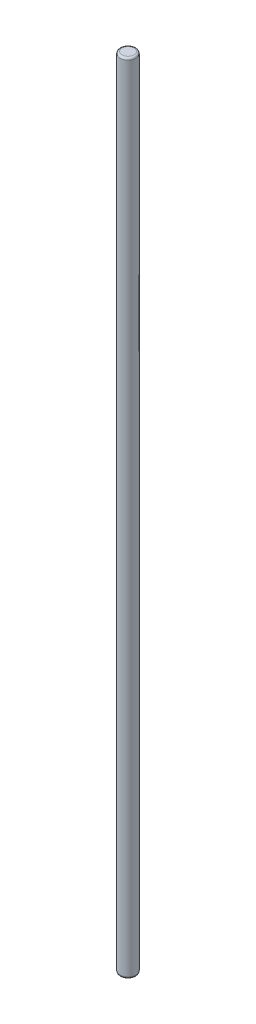
ISO-10303-21;
HEADER;
FILE_DESCRIPTION(('STEP AP214'),'2;1');
FILE_NAME('part.step','',(''),(''),'','','');
FILE_SCHEMA(('AUTOMOTIVE_DESIGN { 1 0 10303 214 1 1 1 1 }'));
ENDSEC;
DATA;
#1=APPLICATION_CONTEXT('core data for automotive mechanical design processes');
#2=APPLICATION_PROTOCOL_DEFINITION('international standard','automotive_design',2000,#1);
#3=PRODUCT_CONTEXT('',#1,'mechanical');
#4=PRODUCT('Part','Part','',(#3));
#5=PRODUCT_RELATED_PRODUCT_CATEGORY('part','',(#4));
#6=PRODUCT_DEFINITION_FORMATION('','',#4);
#7=PRODUCT_DEFINITION_CONTEXT('part definition',#1,'design');
#8=PRODUCT_DEFINITION('design','',#6,#7);
#9=PRODUCT_DEFINITION_SHAPE('','',#8);
#10=(LENGTH_UNIT() NAMED_UNIT(*) SI_UNIT(.MILLI.,.METRE.));
#11=(NAMED_UNIT(*) PLANE_ANGLE_UNIT() SI_UNIT($,.RADIAN.));
#12=(NAMED_UNIT(*) SI_UNIT($,.STERADIAN.) SOLID_ANGLE_UNIT());
#13=UNCERTAINTY_MEASURE_WITH_UNIT(LENGTH_MEASURE(1.E-05),#10,'distance_accuracy_value','');
#14=(GEOMETRIC_REPRESENTATION_CONTEXT(3) GLOBAL_UNCERTAINTY_ASSIGNED_CONTEXT((#13)) GLOBAL_UNIT_ASSIGNED_CONTEXT((#10,
#11,#12)) REPRESENTATION_CONTEXT('',''));
#15=CARTESIAN_POINT('',(0.,0.,0.));
#16=DIRECTION('',(0.,0.,1.));
#17=DIRECTION('',(1.,0.,0.));
#18=AXIS2_PLACEMENT_3D('',#15,#16,#17);
#19=CARTESIAN_POINT('',(0.,400.,0.));
#20=DIRECTION('',(0.,-1.,0.));
#21=DIRECTION('',(0.,0.,-1.));
#22=AXIS2_PLACEMENT_3D('',#19,#20,#21);
#23=CYLINDRICAL_SURFACE('',#22,4.);
#24=CARTESIAN_POINT('',(0.,1.,0.));
#25=DIRECTION('',(0.,1.,0.));
#26=DIRECTION('',(0.,0.,1.));
#27=AXIS2_PLACEMENT_3D('',#24,#25,#26);
#28=CIRCLE('',#27,4.);
#29=CARTESIAN_POINT('',(0.,1.,4.));
#30=VERTEX_POINT('',#29);
#31=EDGE_CURVE('E41',#30,#30,#28,.T.);
#32=ORIENTED_EDGE('',*,*,#31,.T.);
#33=EDGE_LOOP('',(#32));
#34=FACE_BOUND('',#33,.T.);
#35=CARTESIAN_POINT('',(0.,399.,0.));
#36=DIRECTION('',(0.,1.,0.));
#37=DIRECTION('',(0.,0.,1.));
#38=AXIS2_PLACEMENT_3D('',#35,#36,#37);
#39=CIRCLE('',#38,4.);
#40=CARTESIAN_POINT('',(0.,399.,4.));
#41=VERTEX_POINT('',#40);
#42=EDGE_CURVE('E45',#41,#41,#39,.F.);
#43=ORIENTED_EDGE('',*,*,#42,.T.);
#44=EDGE_LOOP('',(#43));
#45=FACE_BOUND('',#44,.T.);
#46=ADVANCED_FACE('F30',(#34,#45),#23,.T.);
#47=CARTESIAN_POINT('',(0.,400.,0.));
#48=DIRECTION('',(0.,1.,0.));
#49=DIRECTION('',(0.,0.,1.));
#50=AXIS2_PLACEMENT_3D('',#47,#48,#49);
#51=PLANE('',#50);
#52=CARTESIAN_POINT('',(0.,400.,0.));
#53=DIRECTION('',(0.,1.,0.));
#54=DIRECTION('',(0.,0.,1.));
#55=AXIS2_PLACEMENT_3D('',#52,#53,#54);
#56=CIRCLE('',#55,3.);
#57=CARTESIAN_POINT('',(0.,400.,3.));
#58=VERTEX_POINT('',#57);
#59=EDGE_CURVE('E10',#58,#58,#56,.T.);
#60=ORIENTED_EDGE('',*,*,#59,.T.);
#61=EDGE_LOOP('',(#60));
#62=FACE_BOUND('',#61,.T.);
#63=ADVANCED_FACE('F61',(#62),#51,.T.);
#64=CARTESIAN_POINT('',(0.,0.,0.));
#65=DIRECTION('',(0.,1.,0.));
#66=DIRECTION('',(0.,0.,1.));
#67=AXIS2_PLACEMENT_3D('',#64,#65,#66);
#68=PLANE('',#67);
#69=CARTESIAN_POINT('',(0.,0.,0.));
#70=DIRECTION('',(0.,1.,0.));
#71=DIRECTION('',(0.,0.,1.));
#72=AXIS2_PLACEMENT_3D('',#69,#70,#71);
#73=CIRCLE('',#72,3.);
#74=CARTESIAN_POINT('',(0.,0.,3.));
#75=VERTEX_POINT('',#74);
#76=EDGE_CURVE('E37',#75,#75,#73,.F.);
#77=ORIENTED_EDGE('',*,*,#76,.T.);
#78=EDGE_LOOP('',(#77));
#79=FACE_BOUND('',#78,.T.);
#80=ADVANCED_FACE('F58',(#79),#68,.F.);
#81=CARTESIAN_POINT('',(0.,1.,0.));
#82=DIRECTION('',(0.,1.,0.));
#83=DIRECTION('',(0.,0.,1.));
#84=AXIS2_PLACEMENT_3D('',#81,#82,#83);
#85=TOROIDAL_SURFACE('',#84,3.,1.);
#86=ORIENTED_EDGE('',*,*,#76,.F.);
#87=EDGE_LOOP('',(#86));
#88=FACE_BOUND('',#87,.T.);
#89=ORIENTED_EDGE('',*,*,#31,.F.);
#90=EDGE_LOOP('',(#89));
#91=FACE_BOUND('',#90,.T.);
#92=ADVANCED_FACE('F54',(#88,#91),#85,.T.);
#93=CARTESIAN_POINT('',(0.,399.,0.));
#94=DIRECTION('',(0.,1.,0.));
#95=DIRECTION('',(0.,0.,1.));
#96=AXIS2_PLACEMENT_3D('',#93,#94,#95);
#97=TOROIDAL_SURFACE('',#96,3.,1.);
#98=ORIENTED_EDGE('',*,*,#42,.F.);
#99=EDGE_LOOP('',(#98));
#100=FACE_BOUND('',#99,.T.);
#101=ORIENTED_EDGE('',*,*,#59,.F.);
#102=EDGE_LOOP('',(#101));
#103=FACE_BOUND('',#102,.T.);
#104=ADVANCED_FACE('F32',(#100,#103),#97,.T.);
#105=CLOSED_SHELL('',(#46,#63,#80,#92,#104));
#106=MANIFOLD_SOLID_BREP('B2',#105);
#107=ADVANCED_BREP_SHAPE_REPRESENTATION('',(#18,#106),#14);
#108=SHAPE_DEFINITION_REPRESENTATION(#9,#107);
ENDSEC;
END-ISO-10303-21;
